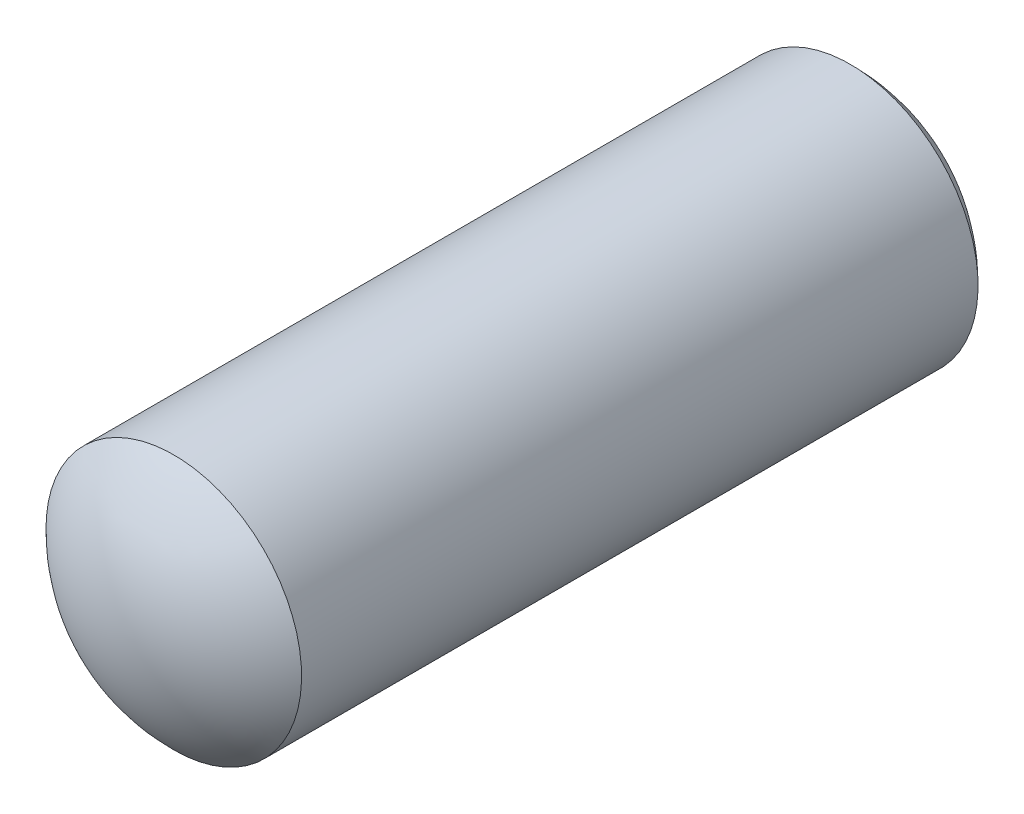
ISO-10303-21;
HEADER;
FILE_DESCRIPTION(('STEP AP214'),'2;1');
FILE_NAME('part.step','',(''),(''),'','','');
FILE_SCHEMA(('AUTOMOTIVE_DESIGN { 1 0 10303 214 1 1 1 1 }'));
ENDSEC;
DATA;
#1=APPLICATION_CONTEXT('core data for automotive mechanical design processes');
#2=APPLICATION_PROTOCOL_DEFINITION('international standard','automotive_design',2000,#1);
#3=PRODUCT_CONTEXT('',#1,'mechanical');
#4=PRODUCT('Part','Part','',(#3));
#5=PRODUCT_RELATED_PRODUCT_CATEGORY('part','',(#4));
#6=PRODUCT_DEFINITION_FORMATION('','',#4);
#7=PRODUCT_DEFINITION_CONTEXT('part definition',#1,'design');
#8=PRODUCT_DEFINITION('design','',#6,#7);
#9=PRODUCT_DEFINITION_SHAPE('','',#8);
#10=(LENGTH_UNIT() NAMED_UNIT(*) SI_UNIT(.MILLI.,.METRE.));
#11=(NAMED_UNIT(*) PLANE_ANGLE_UNIT() SI_UNIT($,.RADIAN.));
#12=(NAMED_UNIT(*) SI_UNIT($,.STERADIAN.) SOLID_ANGLE_UNIT());
#13=UNCERTAINTY_MEASURE_WITH_UNIT(LENGTH_MEASURE(1.E-05),#10,'distance_accuracy_value','');
#14=(GEOMETRIC_REPRESENTATION_CONTEXT(3) GLOBAL_UNCERTAINTY_ASSIGNED_CONTEXT((#13)) GLOBAL_UNIT_ASSIGNED_CONTEXT((#10,
#11,#12)) REPRESENTATION_CONTEXT('',''));
#15=CARTESIAN_POINT('',(0.,0.,0.));
#16=DIRECTION('',(0.,0.,1.));
#17=DIRECTION('',(1.,0.,0.));
#18=AXIS2_PLACEMENT_3D('',#15,#16,#17);
#19=CARTESIAN_POINT('',(-4.93334745928228,-7.67643848708455,7.875));
#20=DIRECTION('',(-0.841253532831181,0.540640817455598,0.));
#21=DIRECTION('',(0.,0.,1.));
#22=AXIS2_PLACEMENT_3D('',#19,#20,#21);
#23=SPHERICAL_SURFACE('',#22,1.575);
#24=CARTESIAN_POINT('',(-4.93334745928228,-7.67643848708455,7.875));
#25=DIRECTION('',(0.,0.,1.));
#26=DIRECTION('',(0.540640817455598,0.841253532831181,0.));
#27=AXIS2_PLACEMENT_3D('',#24,#25,#26);
#28=SPHERICAL_SURFACE('',#27,1.575);
#29=CARTESIAN_POINT('',(-4.93334745928228,-7.67643848708455,8.97727038425245));
#30=DIRECTION('',(0.,0.,1.));
#31=DIRECTION('',(0.540640817455598,0.841253532831181,0.));
#32=AXIS2_PLACEMENT_3D('',#29,#30,#31);
#33=CIRCLE('',#32,1.125);
#34=CARTESIAN_POINT('',(-4.32512653964473,-6.73002826264947,8.97727038425245));
#35=VERTEX_POINT('',#34);
#36=EDGE_CURVE('E11',#35,#35,#33,.T.);
#37=ORIENTED_EDGE('',*,*,#36,.T.);
#38=EDGE_LOOP('',(#37));
#39=FACE_BOUND('',#38,.T.);
#40=ADVANCED_FACE('F17',(#39),#28,.T.);
#41=CARTESIAN_POINT('',(-4.93334745928228,-7.67643848708455,6.));
#42=DIRECTION('',(0.,0.,1.));
#43=DIRECTION('',(0.540640817455598,0.841253532831181,0.));
#44=AXIS2_PLACEMENT_3D('',#41,#42,#43);
#45=CYLINDRICAL_SURFACE('',#44,1.125);
#46=CARTESIAN_POINT('',(-4.93334745928228,-7.67643848708455,3.02272961574759));
#47=DIRECTION('',(0.,0.,1.));
#48=DIRECTION('',(0.540640817455598,0.841253532831181,0.));
#49=AXIS2_PLACEMENT_3D('',#46,#47,#48);
#50=CIRCLE('',#49,1.125);
#51=CARTESIAN_POINT('',(-4.32512653964473,-6.73002826264947,3.02272961574759));
#52=VERTEX_POINT('',#51);
#53=EDGE_CURVE('E26',#52,#52,#50,.T.);
#54=ORIENTED_EDGE('',*,*,#53,.T.);
#55=EDGE_LOOP('',(#54));
#56=FACE_BOUND('',#55,.T.);
#57=ORIENTED_EDGE('',*,*,#36,.F.);
#58=EDGE_LOOP('',(#57));
#59=FACE_BOUND('',#58,.T.);
#60=ADVANCED_FACE('F19',(#56,#59),#45,.T.);
#61=CARTESIAN_POINT('',(-4.93334745928228,-7.67643848708455,4.125));
#62=DIRECTION('',(-0.841253532831181,0.540640817455598,0.));
#63=DIRECTION('',(0.,0.,-1.));
#64=AXIS2_PLACEMENT_3D('',#61,#62,#63);
#65=SPHERICAL_SURFACE('',#64,1.575);
#66=CARTESIAN_POINT('',(-4.93334745928228,-7.67643848708455,4.125));
#67=DIRECTION('',(0.,0.,1.));
#68=DIRECTION('',(0.540640817455598,0.841253532831181,0.));
#69=AXIS2_PLACEMENT_3D('',#66,#67,#68);
#70=SPHERICAL_SURFACE('',#69,1.575);
#71=ORIENTED_EDGE('',*,*,#53,.F.);
#72=EDGE_LOOP('',(#71));
#73=FACE_BOUND('',#72,.T.);
#74=ADVANCED_FACE('F48',(#73),#70,.T.);
#75=CLOSED_SHELL('',(#40,#60,#74));
#76=MANIFOLD_SOLID_BREP('B1',#75);
#77=ADVANCED_BREP_SHAPE_REPRESENTATION('',(#18,#76),#14);
#78=SHAPE_DEFINITION_REPRESENTATION(#9,#77);
ENDSEC;
END-ISO-10303-21;
